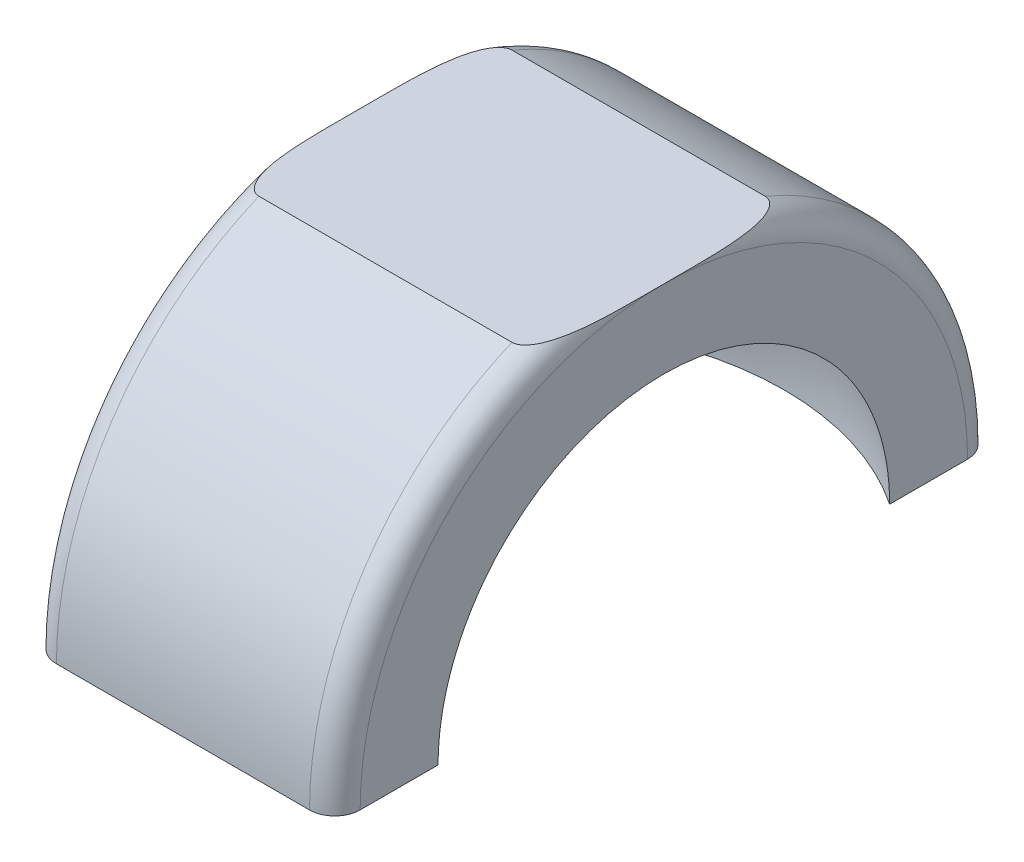
ISO-10303-21;
HEADER;
FILE_DESCRIPTION(('STEP AP214'),'2;1');
FILE_NAME('part.step','',(''),(''),'','','');
FILE_SCHEMA(('AUTOMOTIVE_DESIGN { 1 0 10303 214 1 1 1 1 }'));
ENDSEC;
DATA;
#1=APPLICATION_CONTEXT('core data for automotive mechanical design processes');
#2=APPLICATION_PROTOCOL_DEFINITION('international standard','automotive_design',2000,#1);
#3=PRODUCT_CONTEXT('',#1,'mechanical');
#4=PRODUCT('Part','Part','',(#3));
#5=PRODUCT_RELATED_PRODUCT_CATEGORY('part','',(#4));
#6=PRODUCT_DEFINITION_FORMATION('','',#4);
#7=PRODUCT_DEFINITION_CONTEXT('part definition',#1,'design');
#8=PRODUCT_DEFINITION('design','',#6,#7);
#9=PRODUCT_DEFINITION_SHAPE('','',#8);
#10=(LENGTH_UNIT() NAMED_UNIT(*) SI_UNIT(.MILLI.,.METRE.));
#11=(NAMED_UNIT(*) PLANE_ANGLE_UNIT() SI_UNIT($,.RADIAN.));
#12=(NAMED_UNIT(*) SI_UNIT($,.STERADIAN.) SOLID_ANGLE_UNIT());
#13=UNCERTAINTY_MEASURE_WITH_UNIT(LENGTH_MEASURE(1.E-05),#10,'distance_accuracy_value','');
#14=(GEOMETRIC_REPRESENTATION_CONTEXT(3) GLOBAL_UNCERTAINTY_ASSIGNED_CONTEXT((#13)) GLOBAL_UNIT_ASSIGNED_CONTEXT((#10,
#11,#12)) REPRESENTATION_CONTEXT('',''));
#15=CARTESIAN_POINT('',(0.,0.,0.));
#16=DIRECTION('',(0.,0.,1.));
#17=DIRECTION('',(1.,0.,0.));
#18=AXIS2_PLACEMENT_3D('',#15,#16,#17);
#19=CARTESIAN_POINT('',(10.,0.,0.));
#20=DIRECTION('',(-1.,0.,0.));
#21=DIRECTION('',(0.,0.,1.));
#22=AXIS2_PLACEMENT_3D('',#19,#20,#21);
#23=TOROIDAL_SURFACE('',#22,24.,2.);
#24=CARTESIAN_POINT('',(12.,0.,0.));
#25=DIRECTION('',(-1.,0.,0.));
#26=DIRECTION('',(0.,0.,1.));
#27=AXIS2_PLACEMENT_3D('',#24,#25,#26);
#28=CIRCLE('',#27,24.);
#29=CARTESIAN_POINT('',(12.,0.,24.));
#30=VERTEX_POINT('',#29);
#31=CARTESIAN_POINT('',(12.,24.,0.));
#32=VERTEX_POINT('',#31);
#33=EDGE_CURVE('E41',#30,#32,#28,.T.);
#34=ORIENTED_EDGE('',*,*,#33,.T.);
#35=CARTESIAN_POINT('',(12.0000000000002,24.,0.));
#36=CARTESIAN_POINT('',(12.0000032112972,24.,0.333318370624944));
#37=CARTESIAN_POINT('',(12.0000369376425,24.,0.666636690385218));
#38=CARTESIAN_POINT('',(11.9997462691406,24.,1.33327477904077));
#39=CARTESIAN_POINT('',(11.9994218731332,24.,1.66659454793725));
#40=CARTESIAN_POINT('',(11.9971167553539,24.,2.33330585522278));
#41=CARTESIAN_POINT('',(11.995135657108,24.,2.66669739270359));
#42=CARTESIAN_POINT('',(11.987382631693,24.,3.33342237898503));
#43=CARTESIAN_POINT('',(11.9816110138256,24.,3.66675583030574));
#44=CARTESIAN_POINT('',(11.9660821554231,24.,4.22925457777455));
#45=CARTESIAN_POINT('',(11.9581306579488,24.,4.45846690104528));
#46=CARTESIAN_POINT('',(11.9376839843161,24.,4.91668810412272));
#47=CARTESIAN_POINT('',(11.9251890218679,24.,5.14569699299054));
#48=CARTESIAN_POINT('',(11.8940563210572,24.,5.60339568674352));
#49=CARTESIAN_POINT('',(11.8754163137367,24.,5.83208534238817));
#50=CARTESIAN_POINT('',(11.8299717017088,24.,6.28863487959647));
#51=CARTESIAN_POINT('',(11.8031689811131,24.,6.5164949403774));
#52=CARTESIAN_POINT('',(11.7472776739321,24.,6.91014618979482));
#53=CARTESIAN_POINT('',(11.7207036250663,24.,7.07628927305245));
#54=CARTESIAN_POINT('',(11.6602651251751,24.,7.40722844639932));
#55=CARTESIAN_POINT('',(11.6264021712281,24.,7.57202480589031));
#56=CARTESIAN_POINT('',(11.5494119212752,24.,7.89981844597661));
#57=CARTESIAN_POINT('',(11.5062684373758,24.,8.06281205295968));
#58=CARTESIAN_POINT('',(11.4325985380382,24.,8.3045026196003));
#59=CARTESIAN_POINT('',(11.4065607418726,24.,8.38457040780352));
#60=CARTESIAN_POINT('',(11.3510253330141,24.,8.54349044057223));
#61=CARTESIAN_POINT('',(11.321528415153,24.,8.62234292566682));
#62=CARTESIAN_POINT('',(11.2581656766794,24.,8.77926831696839));
#63=CARTESIAN_POINT('',(11.2242565034422,24.,8.85732386543028));
#64=CARTESIAN_POINT('',(11.1515835022793,24.,9.01112038904928));
#65=CARTESIAN_POINT('',(11.1128221897752,24.,9.08686253837903));
#66=CARTESIAN_POINT('',(11.0297277782235,24.,9.23464189441576));
#67=CARTESIAN_POINT('',(10.9854309122107,24.,9.3066992506055));
#68=CARTESIAN_POINT('',(10.8899193526613,24.,9.44601447281588));
#69=CARTESIAN_POINT('',(10.8387168937979,24.,9.51328051264976));
#70=CARTESIAN_POINT('',(10.7452380030842,24.,9.62063081920906));
#71=CARTESIAN_POINT('',(10.7051812793181,24.,9.66263473592002));
#72=CARTESIAN_POINT('',(10.6205313029516,24.,9.74197770663356));
#73=CARTESIAN_POINT('',(10.5759332419576,24.,9.77931172096246));
#74=CARTESIAN_POINT('',(10.4813819449202,24.,9.84781787827383));
#75=CARTESIAN_POINT('',(10.4313750129516,24.,9.87891742712105));
#76=CARTESIAN_POINT('',(10.3266729907569,24.,9.93185418938677));
#77=CARTESIAN_POINT('',(10.2719900844932,24.,9.95371464266827));
#78=CARTESIAN_POINT('',(10.1730273511311,24.,9.98169520964225));
#79=CARTESIAN_POINT('',(10.129468790481,24.,9.99035573108248));
#80=CARTESIAN_POINT('',(10.0415136477378,24.,10.0001366298849));
#81=CARTESIAN_POINT('',(9.99711761101358,24.,10.0012617551721));
#82=CARTESIAN_POINT('',(9.90882676394153,24.,9.99586257111336));
#83=CARTESIAN_POINT('',(9.86493171650638,24.,9.98934204559354));
#84=CARTESIAN_POINT('',(9.77878109124616,24.,9.96928364420115));
#85=CARTESIAN_POINT('',(9.7365269146013,24.,9.95573990676722));
#86=CARTESIAN_POINT('',(9.63992720292629,24.,9.91684528754731));
#87=CARTESIAN_POINT('',(9.58658719557515,24.,9.88901308058598));
#88=CARTESIAN_POINT('',(9.48501505356487,24.,9.82524143179271));
#89=CARTESIAN_POINT('',(9.43679494660291,24.,9.78928349439656));
#90=CARTESIAN_POINT('',(9.31596862747712,24.,9.6866929371816));
#91=CARTESIAN_POINT('',(9.24755308269309,24.,9.61517616781321));
#92=CARTESIAN_POINT('',(9.12173798187126,24.,9.46311544551836));
#93=CARTESIAN_POINT('',(9.06436974993364,24.,9.38254682034423));
#94=CARTESIAN_POINT('',(8.95651782036297,24.,9.21279170083568));
#95=CARTESIAN_POINT('',(8.90636765207394,24.,9.12339658073665));
#96=CARTESIAN_POINT('',(8.81362150969052,24.,8.9407222863304));
#97=CARTESIAN_POINT('',(8.77103405557575,24.,8.84743887576215));
#98=CARTESIAN_POINT('',(8.69200154728926,24.,8.65821094587404));
#99=CARTESIAN_POINT('',(8.65556358713586,24.,8.56226349986666));
#100=CARTESIAN_POINT('',(8.58785036928036,24.,8.36865771043921));
#101=CARTESIAN_POINT('',(8.55657165945949,24.,8.27100055979621));
#102=CARTESIAN_POINT('',(8.49452950865645,24.,8.06158756638733));
#103=CARTESIAN_POINT('',(8.46436615854089,24.,7.94965518527957));
#104=CARTESIAN_POINT('',(8.40865247510728,24.,7.7246404670472));
#105=CARTESIAN_POINT('',(8.38310307614887,24.,7.6115579018884));
#106=CARTESIAN_POINT('',(8.31224888257978,24.,7.2709188779993));
#107=CARTESIAN_POINT('',(8.27278734062413,24.,7.04214664364708));
#108=CARTESIAN_POINT('',(8.20517744522899,24.,6.58219576041598));
#109=CARTESIAN_POINT('',(8.17706983811534,24.,6.35101144599837));
#110=CARTESIAN_POINT('',(8.12947856099722,24.,5.8877340102058));
#111=CARTESIAN_POINT('',(8.10999655460494,24.,5.65564072221853));
#112=CARTESIAN_POINT('',(8.07725644923241,24.,5.18768771328294));
#113=CARTESIAN_POINT('',(8.06409170355674,24.,4.95182174939653));
#114=CARTESIAN_POINT('',(8.04263936971829,24.,4.47985352954237));
#115=CARTESIAN_POINT('',(8.03435229573301,24.,4.24375125129052));
#116=CARTESIAN_POINT('',(8.02126725748994,24.,3.77221548470928));
#117=CARTESIAN_POINT('',(8.01645816840742,24.,3.53678228489565));
#118=CARTESIAN_POINT('',(8.00916079848506,24.,3.0658976655751));
#119=CARTESIAN_POINT('',(8.00667237456718,24.,2.83044624808663));
#120=CARTESIAN_POINT('',(8.00314726486056,24.,2.36271223492861));
#121=CARTESIAN_POINT('',(8.00209143795818,24.,2.13042976235398));
#122=CARTESIAN_POINT('',(8.00071789688515,24.,1.66586244272779));
#123=CARTESIAN_POINT('',(8.00040018509202,24.,1.43357759567101));
#124=CARTESIAN_POINT('',(8.00005119091622,24.,0.968972711085982));
#125=CARTESIAN_POINT('',(8.00001995184136,24.,0.736652673546385));
#126=CARTESIAN_POINT('',(7.99999408475305,24.,0.272013202606699));
#127=CARTESIAN_POINT('',(7.99999945664451,24.,0.0396937692066078));
#128=CARTESIAN_POINT('',(8.00000084678883,24.,-0.426510676514846));
#129=CARTESIAN_POINT('',(7.9999968017643,24.,-0.660395688814065));
#130=CARTESIAN_POINT('',(8.00014190259765,24.,-1.12816670466346));
#131=CARTESIAN_POINT('',(8.00029104909999,24.,-1.36205270821367));
#132=CARTESIAN_POINT('',(8.00111370574869,24.,-1.82969701927461));
#133=CARTESIAN_POINT('',(8.00178693088462,24.,-2.06345532710612));
#134=CARTESIAN_POINT('',(8.0042336004762,24.,-2.53096518392172));
#135=CARTESIAN_POINT('',(8.00600703510534,24.,-2.76471673294754));
#136=CARTESIAN_POINT('',(8.01137795427343,24.,-3.22707915213118));
#137=CARTESIAN_POINT('',(8.01493462465703,24.,-3.45569044824237));
#138=CARTESIAN_POINT('',(8.02478304215701,24.,-3.91285583709429));
#139=CARTESIAN_POINT('',(8.03107475920861,24.,-4.14140993043618));
#140=CARTESIAN_POINT('',(8.04756811288698,24.,-4.59893086306326));
#141=CARTESIAN_POINT('',(8.05777905958928,24.,-4.82789738305847));
#142=CARTESIAN_POINT('',(8.08354488483207,24.,-5.28551435799917));
#143=CARTESIAN_POINT('',(8.09909907992984,24.,-5.51416484961358));
#144=CARTESIAN_POINT('',(8.13712372410515,24.,-5.96806426630645));
#145=CARTESIAN_POINT('',(8.15950647070729,24.,-6.19332035270045));
#146=CARTESIAN_POINT('',(8.21348655696245,24.,-6.64272797005468));
#147=CARTESIAN_POINT('',(8.2450817096124,24.,-6.86687975034626));
#148=CARTESIAN_POINT('',(8.30163784859851,24.,-7.20113297539648));
#149=CARTESIAN_POINT('',(8.32197124184282,24.,-7.31201894796625));
#150=CARTESIAN_POINT('',(8.36620724524363,24.,-7.53307208686932));
#151=CARTESIAN_POINT('',(8.39010944562003,24.,-7.64323933421482));
#152=CARTESIAN_POINT('',(8.44206801029076,24.,-7.86247240563955));
#153=CARTESIAN_POINT('',(8.47011992287844,24.,-7.97153927786498));
#154=CARTESIAN_POINT('',(8.5311633401834,24.,-8.18827023811862));
#155=CARTESIAN_POINT('',(8.56415327897659,24.,-8.29593475913078));
#156=CARTESIAN_POINT('',(8.61466662939372,24.,-8.44574106167869));
#157=CARTESIAN_POINT('',(8.6297032570958,24.,-8.48872635133043));
#158=CARTESIAN_POINT('',(8.66083866445632,24.,-8.5743183232767));
#159=CARTESIAN_POINT('',(8.67693762337307,24.,-8.6169249402904));
#160=CARTESIAN_POINT('',(8.72699164897903,24.,-8.74415829254694));
#161=CARTESIAN_POINT('',(8.76267715155773,24.,-8.82811809808563));
#162=CARTESIAN_POINT('',(8.83931969761989,24.,-8.99302837938143));
#163=CARTESIAN_POINT('',(8.88024511873908,24.,-9.07399342998768));
#164=CARTESIAN_POINT('',(8.96863876303755,24.,-9.23222566903728));
#165=CARTESIAN_POINT('',(9.01609931038123,24.,-9.30949705450595));
#166=CARTESIAN_POINT('',(9.10636111904431,24.,-9.44011000529705));
#167=CARTESIAN_POINT('',(9.14741752266106,24.,-9.49464784915385));
#168=CARTESIAN_POINT('',(9.23499202878933,24.,-9.59941876467231));
#169=CARTESIAN_POINT('',(9.28152108088911,24.,-9.64964284594727));
#170=CARTESIAN_POINT('',(9.3813411272815,24.,-9.74420685424307));
#171=CARTESIAN_POINT('',(9.43470272076706,24.,-9.78847371669067));
#172=CARTESIAN_POINT('',(9.54823001297531,24.,-9.86718895224718));
#173=CARTESIAN_POINT('',(9.60837134174992,24.,-9.9016710178199));
#174=CARTESIAN_POINT('',(9.7135502774502,24.,-9.94747630826742));
#175=CARTESIAN_POINT('',(9.75688505479648,24.,-9.9626880147675));
#176=CARTESIAN_POINT('',(9.84548101624645,24.,-9.98574109251738));
#177=CARTESIAN_POINT('',(9.89074030445104,24.,-9.99358954941912));
#178=CARTESIAN_POINT('',(9.98212867114721,24.,-10.0011557954406));
#179=CARTESIAN_POINT('',(10.0282604715755,24.,-10.0008414669901));
#180=CARTESIAN_POINT('',(10.1197394795816,24.,-9.99203622265434));
#181=CARTESIAN_POINT('',(10.1650863089253,24.,-9.98354147090436));
#182=CARTESIAN_POINT('',(10.2518309149631,24.,-9.95974527501826));
#183=CARTESIAN_POINT('',(10.2933146290992,24.,-9.94474933730522));
#184=CARTESIAN_POINT('',(10.3737684132198,24.,-9.90915072481761));
#185=CARTESIAN_POINT('',(10.4127375521171,24.,-9.88854598780835));
#186=CARTESIAN_POINT('',(10.514310353692,24.,-9.82681028590918));
#187=CARTESIAN_POINT('',(10.5743167505716,24.,-9.78141983209891));
#188=CARTESIAN_POINT('',(10.6867601738288,24.,-9.68204746446342));
#189=CARTESIAN_POINT('',(10.7391710802959,24.,-9.6280371860263));
#190=CARTESIAN_POINT('',(10.8334718249548,24.,-9.51885468523465));
#191=CARTESIAN_POINT('',(10.8758653995675,24.,-9.46410990591669));
#192=CARTESIAN_POINT('',(10.955865319261,24.,-9.35119562209922));
#193=CARTESIAN_POINT('',(10.993467288732,24.,-9.29302305728638));
#194=CARTESIAN_POINT('',(11.0646165213932,24.,-9.17413072766235));
#195=CARTESIAN_POINT('',(11.0981563479977,24.,-9.11340655728604));
#196=CARTESIAN_POINT('',(11.1616716941555,24.,-8.99016734569872));
#197=CARTESIAN_POINT('',(11.1916485345535,24.,-8.92765297886867));
#198=CARTESIAN_POINT('',(11.2622823804187,24.,-8.77070588448407));
#199=CARTESIAN_POINT('',(11.3011003935321,24.,-8.67544711598761));
#200=CARTESIAN_POINT('',(11.3732088503867,24.,-8.48284081520179));
#201=CARTESIAN_POINT('',(11.406496512795,24.,-8.38549225953626));
#202=CARTESIAN_POINT('',(11.4684843216113,24.,-8.18917313339979));
#203=CARTESIAN_POINT('',(11.4971765073101,24.,-8.09020006880909));
#204=CARTESIAN_POINT('',(11.550609774882,24.,-7.89118646355778));
#205=CARTESIAN_POINT('',(11.575350152715,24.,-7.79114573606544));
#206=CARTESIAN_POINT('',(11.6447376713912,24.,-7.48887108554338));
#207=CARTESIAN_POINT('',(11.6842576192666,24.,-7.28545818128766));
#208=CARTESIAN_POINT('',(11.7530008244918,24.,-6.87720545550559));
#209=CARTESIAN_POINT('',(11.7822352536171,24.,-6.67236743013971));
#210=CARTESIAN_POINT('',(11.8405401585336,24.,-6.19926402227572));
#211=CARTESIAN_POINT('',(11.8668540655969,24.,-5.93066406958119));
#212=CARTESIAN_POINT('',(11.9099344136815,24.,-5.39268113493136));
#213=CARTESIAN_POINT('',(11.9266983618385,24.,-5.12329796695763));
#214=CARTESIAN_POINT('',(11.9534755921896,24.,-4.58390967942385));
#215=CARTESIAN_POINT('',(11.9634812739808,24.,-4.31390420114343));
#216=CARTESIAN_POINT('',(11.9788819188098,24.,-3.77375930489971));
#217=CARTESIAN_POINT('',(11.9842766375968,24.,-3.50361988059937));
#218=CARTESIAN_POINT('',(11.9921348699951,24.,-2.96395555881359));
#219=CARTESIAN_POINT('',(11.9946054270657,24.,-2.69443075182466));
#220=CARTESIAN_POINT('',(11.9979221739512,24.,-2.15536833218577));
#221=CARTESIAN_POINT('',(11.998768333373,24.,-1.88583071939057));
#222=CARTESIAN_POINT('',(11.9997534150278,24.,-1.34691063250215));
#223=CARTESIAN_POINT('',(11.9998927458558,24.,-1.07752815880793));
#224=CARTESIAN_POINT('',(12.0000147405231,24.,-0.538763779001592));
#225=CARTESIAN_POINT('',(11.9999974046881,24.,-0.269381872889463));
#226=CARTESIAN_POINT('',(12.0000000000002,24.,0.));
#227=B_SPLINE_CURVE_WITH_KNOTS('',3,(#35,#36,#37,#38,#39,#40,#41,#42,#43,#44,#45,#46,#47,#48,
#49,#50,#51,#52,#53,#54,#55,#56,#57,#58,#59,#60,#61,#62,#63,#64,#65,#66,#67,#68,#69,#70,#71,#72,
#73,#74,#75,#76,#77,#78,#79,#80,#81,#82,#83,#84,#85,#86,#87,#88,#89,#90,#91,#92,#93,#94,#95,#96,
#97,#98,#99,#100,#101,#102,#103,#104,#105,#106,#107,#108,#109,#110,#111,#112,#113,#114,#115,
#116,#117,#118,#119,#120,#121,#122,#123,#124,#125,#126,#127,#128,#129,#130,#131,#132,#133,#134,
#135,#136,#137,#138,#139,#140,#141,#142,#143,#144,#145,#146,#147,#148,#149,#150,#151,#152,#153,
#154,#155,#156,#157,#158,#159,#160,#161,#162,#163,#164,#165,#166,#167,#168,#169,#170,#171,#172,
#173,#174,#175,#176,#177,#178,#179,#180,#181,#182,#183,#184,#185,#186,#187,#188,#189,#190,#191,
#192,#193,#194,#195,#196,#197,#198,#199,#200,#201,#202,#203,#204,#205,#206,#207,#208,#209,#210,
#211,#212,#213,#214,#215,#216,#217,#218,#219,#220,#221,#222,#223,#224,#225,#226),.UNSPECIFIED.,
.T.,.F.,(4,2,2,2,2,2,2,2,2,2,2,2,2,2,2,2,2,2,2,2,2,2,2,2,2,2,2,2,2,2,2,2,2,2,2,2,2,2,2,2,2,2,2,
2,2,2,2,2,2,2,2,2,2,2,2,2,2,2,2,2,2,2,2,2,2,2,2,2,2,2,2,2,2,2,2,2,2,2,2,2,2,2,2,2,2,2,2,2,2,2,2,
2,2,2,2,4),(0.,0.99995520066757,1.99991364085758,3.00009937632531,4.00020350803274,
4.68822289830605,5.37620993050771,6.06445127579582,6.7525338819526,7.25716920444684,
7.76170097792134,8.26712004020252,8.5196428665089,8.77211505530158,9.02728751227203,
9.28232822765567,9.53577935003109,9.78878719038112,9.96263311325961,10.1366650578676,
10.3126187322994,10.4881271430685,10.6207682454853,10.7533257651287,10.8858177098474,
11.0184204105261,11.1978955251223,11.377783346028,11.6730245875488,11.9690910269845,
12.2761189589302,12.5834906169361,12.89121446854,13.1987315755983,13.5463854768731,
13.8941097019101,14.5901038270583,15.2885739657189,15.9871787590936,16.6958114613416,
17.4045188504047,18.1109491903295,18.8173359731965,19.5141884914985,20.2110432544059,
20.908003363336,21.6049616623497,22.3066167079768,23.0082747054134,23.7095513855221,
24.4108218022766,25.0967281630302,25.7826269842007,26.4701653345502,27.1576157761593,
27.8365842680351,28.515391705474,28.8535504002588,29.1916702965621,29.5294300620778,
29.8670829448073,30.0036890418505,30.1403182491153,30.4138306184936,30.6857639793563,
30.9573806228073,31.1619053410741,31.3668464624063,31.5741081042875,31.7806471634418,
31.9178874178861,32.0549954702209,32.1926430739583,32.330355253181,32.4621986005242,
32.594090489457,32.8185048924268,33.0436735917432,33.2510871706001,33.4586888188927,
33.666664956936,33.8745637534841,34.1829259351316,34.4914427323997,34.8004883218504,
35.1095889084977,35.7308334264169,36.3514010715602,37.1607941011896,37.9703983132472,
38.7809115037339,39.5914676258798,40.4000673537083,41.2086822105647,42.0168295797907,
42.8249752702198),.UNSPECIFIED.);
#228=CARTESIAN_POINT('',(9.99999999999999,24.,9.99999999999999));
#229=VERTEX_POINT('',#228);
#230=EDGE_CURVE('E104',#32,#229,#227,.T.);
#231=ORIENTED_EDGE('',*,*,#230,.T.);
#232=CARTESIAN_POINT('',(9.99999999999999,0.,0.));
#233=DIRECTION('',(-1.,0.,0.));
#234=DIRECTION('',(0.,0.,1.));
#235=AXIS2_PLACEMENT_3D('',#232,#233,#234);
#236=CIRCLE('',#235,26.);
#237=CARTESIAN_POINT('',(9.99999999999999,0.,26.));
#238=VERTEX_POINT('',#237);
#239=EDGE_CURVE('E128',#238,#229,#236,.T.);
#240=ORIENTED_EDGE('',*,*,#239,.F.);
#241=CARTESIAN_POINT('',(10.,0.,24.));
#242=DIRECTION('',(0.,-1.,0.));
#243=DIRECTION('',(1.,0.,0.));
#244=AXIS2_PLACEMENT_3D('',#241,#242,#243);
#245=CIRCLE('',#244,2.);
#246=EDGE_CURVE('E126',#30,#238,#245,.T.);
#247=ORIENTED_EDGE('',*,*,#246,.F.);
#248=EDGE_LOOP('',(#34,#231,#240,#247));
#249=FACE_BOUND('',#248,.T.);
#250=ADVANCED_FACE('F33',(#249),#23,.T.);
#251=CARTESIAN_POINT('',(-22.,0.,0.));
#252=DIRECTION('',(-1.,0.,0.));
#253=DIRECTION('',(0.,0.,1.));
#254=AXIS2_PLACEMENT_3D('',#251,#252,#253);
#255=CYLINDRICAL_SURFACE('',#254,26.);
#256=DIRECTION('',(-1.,0.,0.));
#257=VECTOR('',#256,1.);
#258=CARTESIAN_POINT('',(-22.,24.,9.99999999999999));
#259=LINE('',#258,#257);
#260=CARTESIAN_POINT('',(-9.99999999999971,24.,10.0000000000003));
#261=VERTEX_POINT('',#260);
#262=EDGE_CURVE('E110',#261,#229,#259,.F.);
#263=ORIENTED_EDGE('',*,*,#262,.F.);
#264=CARTESIAN_POINT('',(-9.99999999999998,0.,0.));
#265=DIRECTION('',(-1.,0.,0.));
#266=DIRECTION('',(0.,0.,1.));
#267=AXIS2_PLACEMENT_3D('',#264,#265,#266);
#268=CIRCLE('',#267,26.);
#269=CARTESIAN_POINT('',(-9.99999999999998,0.,26.));
#270=VERTEX_POINT('',#269);
#271=EDGE_CURVE('E132',#270,#261,#268,.T.);
#272=ORIENTED_EDGE('',*,*,#271,.F.);
#273=DIRECTION('',(1.,0.,0.));
#274=VECTOR('',#273,1.);
#275=CARTESIAN_POINT('',(-9.99999999999998,0.,26.));
#276=LINE('',#275,#274);
#277=EDGE_CURVE('E146',#270,#238,#276,.T.);
#278=ORIENTED_EDGE('',*,*,#277,.T.);
#279=ORIENTED_EDGE('',*,*,#239,.T.);
#280=EDGE_LOOP('',(#263,#272,#278,#279));
#281=FACE_BOUND('',#280,.T.);
#282=ADVANCED_FACE('F203',(#281),#255,.T.);
#283=CARTESIAN_POINT('',(-10.,0.,0.));
#284=DIRECTION('',(-1.,0.,0.));
#285=DIRECTION('',(0.,0.,1.));
#286=AXIS2_PLACEMENT_3D('',#283,#284,#285);
#287=TOROIDAL_SURFACE('',#286,24.,2.);
#288=CARTESIAN_POINT('',(-12.,0.,0.));
#289=DIRECTION('',(-1.,0.,0.));
#290=DIRECTION('',(0.,0.,1.));
#291=AXIS2_PLACEMENT_3D('',#288,#289,#290);
#292=CIRCLE('',#291,24.);
#293=CARTESIAN_POINT('',(-12.,24.,0.));
#294=VERTEX_POINT('',#293);
#295=CARTESIAN_POINT('',(-12.,0.,-24.));
#296=VERTEX_POINT('',#295);
#297=EDGE_CURVE('E139',#294,#296,#292,.T.);
#298=ORIENTED_EDGE('',*,*,#297,.F.);
#299=CARTESIAN_POINT('',(-12.0000000000002,24.,0.));
#300=CARTESIAN_POINT('',(-12.0000032112972,24.,-0.333318370624944));
#301=CARTESIAN_POINT('',(-12.0000369376425,24.,-0.666636690385219));
#302=CARTESIAN_POINT('',(-11.9997462691406,24.,-1.33327477904078));
#303=CARTESIAN_POINT('',(-11.9994218731332,24.,-1.66659454793725));
#304=CARTESIAN_POINT('',(-11.9971167553539,24.,-2.33330585522278));
#305=CARTESIAN_POINT('',(-11.995135657108,24.,-2.66669739270359));
#306=CARTESIAN_POINT('',(-11.987382631693,24.,-3.33342237898503));
#307=CARTESIAN_POINT('',(-11.9816110138256,24.,-3.66675583030574));
#308=CARTESIAN_POINT('',(-11.9660821554231,24.,-4.22925457777455));
#309=CARTESIAN_POINT('',(-11.9581306579488,24.,-4.45846690104528));
#310=CARTESIAN_POINT('',(-11.9376839843161,24.,-4.91668810412272));
#311=CARTESIAN_POINT('',(-11.9251890218679,24.,-5.14569699299054));
#312=CARTESIAN_POINT('',(-11.8940563210572,24.,-5.60339568674351));
#313=CARTESIAN_POINT('',(-11.8754163137367,24.,-5.83208534238818));
#314=CARTESIAN_POINT('',(-11.8299717017088,24.,-6.28863487959647));
#315=CARTESIAN_POINT('',(-11.8031689811131,24.,-6.5164949403774));
#316=CARTESIAN_POINT('',(-11.7472776739321,24.,-6.91014618979482));
#317=CARTESIAN_POINT('',(-11.7207036250663,24.,-7.07628927305246));
#318=CARTESIAN_POINT('',(-11.6602651251751,24.,-7.40722844639932));
#319=CARTESIAN_POINT('',(-11.6264021712281,24.,-7.57202480589032));
#320=CARTESIAN_POINT('',(-11.5494119212752,24.,-7.89981844597661));
#321=CARTESIAN_POINT('',(-11.5062684373758,24.,-8.06281205295969));
#322=CARTESIAN_POINT('',(-11.4325985380382,24.,-8.30450261960031));
#323=CARTESIAN_POINT('',(-11.4065607418726,24.,-8.38457040780352));
#324=CARTESIAN_POINT('',(-11.3510253330141,24.,-8.54349044057223));
#325=CARTESIAN_POINT('',(-11.321528415153,24.,-8.62234292566683));
#326=CARTESIAN_POINT('',(-11.2581656766794,24.,-8.77926831696839));
#327=CARTESIAN_POINT('',(-11.2242565034422,24.,-8.85732386543029));
#328=CARTESIAN_POINT('',(-11.1515835022793,24.,-9.01112038904928));
#329=CARTESIAN_POINT('',(-11.1128221897752,24.,-9.08686253837904));
#330=CARTESIAN_POINT('',(-11.0297277782235,24.,-9.23464189441576));
#331=CARTESIAN_POINT('',(-10.9854309122107,24.,-9.3066992506055));
#332=CARTESIAN_POINT('',(-10.8899193526613,24.,-9.44601447281589));
#333=CARTESIAN_POINT('',(-10.8387168937979,24.,-9.51328051264976));
#334=CARTESIAN_POINT('',(-10.7452380030842,24.,-9.62063081920907));
#335=CARTESIAN_POINT('',(-10.7051812793181,24.,-9.66263473592003));
#336=CARTESIAN_POINT('',(-10.6205313029516,24.,-9.74197770663357));
#337=CARTESIAN_POINT('',(-10.5759332419576,24.,-9.77931172096247));
#338=CARTESIAN_POINT('',(-10.4813819449202,24.,-9.84781787827384));
#339=CARTESIAN_POINT('',(-10.4313750129516,24.,-9.87891742712106));
#340=CARTESIAN_POINT('',(-10.3266729907569,24.,-9.93185418938679));
#341=CARTESIAN_POINT('',(-10.2719900844931,24.,-9.95371464266829));
#342=CARTESIAN_POINT('',(-10.1730273511311,24.,-9.98169520964226));
#343=CARTESIAN_POINT('',(-10.129468790481,24.,-9.99035573108248));
#344=CARTESIAN_POINT('',(-10.0415136477378,24.,-10.0001366298849));
#345=CARTESIAN_POINT('',(-9.99711761101358,24.,-10.0012617551721));
#346=CARTESIAN_POINT('',(-9.90882676394152,24.,-9.99586257111337));
#347=CARTESIAN_POINT('',(-9.86493171650638,24.,-9.98934204559354));
#348=CARTESIAN_POINT('',(-9.77878109124616,24.,-9.96928364420116));
#349=CARTESIAN_POINT('',(-9.7365269146013,24.,-9.95573990676723));
#350=CARTESIAN_POINT('',(-9.63992720292629,24.,-9.91684528754733));
#351=CARTESIAN_POINT('',(-9.58658719557514,24.,-9.889013080586));
#352=CARTESIAN_POINT('',(-9.48501505356487,24.,-9.82524143179272));
#353=CARTESIAN_POINT('',(-9.4367949466029,24.,-9.78928349439657));
#354=CARTESIAN_POINT('',(-9.31596862747713,24.,-9.68669293718161));
#355=CARTESIAN_POINT('',(-9.2475530826931,24.,-9.61517616781322));
#356=CARTESIAN_POINT('',(-9.12173798187127,24.,-9.46311544551837));
#357=CARTESIAN_POINT('',(-9.06436974993364,24.,-9.38254682034425));
#358=CARTESIAN_POINT('',(-8.95651782036297,24.,-9.21279170083571));
#359=CARTESIAN_POINT('',(-8.90636765207394,24.,-9.12339658073668));
#360=CARTESIAN_POINT('',(-8.81362150969052,24.,-8.94072228633042));
#361=CARTESIAN_POINT('',(-8.77103405557576,24.,-8.84743887576218));
#362=CARTESIAN_POINT('',(-8.69200154728927,24.,-8.65821094587407));
#363=CARTESIAN_POINT('',(-8.65556358713586,24.,-8.56226349986668));
#364=CARTESIAN_POINT('',(-8.58785036928036,24.,-8.36865771043923));
#365=CARTESIAN_POINT('',(-8.55657165945949,24.,-8.27100055979624));
#366=CARTESIAN_POINT('',(-8.49452950865645,24.,-8.06158756638736));
#367=CARTESIAN_POINT('',(-8.46436615854089,24.,-7.9496551852796));
#368=CARTESIAN_POINT('',(-8.40865247510728,24.,-7.72464046704724));
#369=CARTESIAN_POINT('',(-8.38310307614887,24.,-7.61155790188844));
#370=CARTESIAN_POINT('',(-8.31224888257978,24.,-7.27091887799935));
#371=CARTESIAN_POINT('',(-8.27278734062413,24.,-7.04214664364713));
#372=CARTESIAN_POINT('',(-8.20517744522899,24.,-6.58219576041603));
#373=CARTESIAN_POINT('',(-8.17706983811534,24.,-6.35101144599842));
#374=CARTESIAN_POINT('',(-8.12947856099722,24.,-5.88773401020586));
#375=CARTESIAN_POINT('',(-8.10999655460495,24.,-5.65564072221859));
#376=CARTESIAN_POINT('',(-8.07725644923241,24.,-5.18768771328301));
#377=CARTESIAN_POINT('',(-8.06409170355674,24.,-4.95182174939661));
#378=CARTESIAN_POINT('',(-8.04263936971829,24.,-4.47985352954246));
#379=CARTESIAN_POINT('',(-8.03435229573301,24.,-4.24375125129062));
#380=CARTESIAN_POINT('',(-8.02126725748994,24.,-3.77221548470939));
#381=CARTESIAN_POINT('',(-8.01645816840742,24.,-3.53678228489576));
#382=CARTESIAN_POINT('',(-8.00916079848506,24.,-3.06589766557523));
#383=CARTESIAN_POINT('',(-8.00667237456718,24.,-2.83044624808675));
#384=CARTESIAN_POINT('',(-8.00314726486056,24.,-2.36271223492875));
#385=CARTESIAN_POINT('',(-8.00209143795817,24.,-2.13042976235412));
#386=CARTESIAN_POINT('',(-8.00071789688514,24.,-1.66586244272795));
#387=CARTESIAN_POINT('',(-8.00040018509202,24.,-1.43357759567117));
#388=CARTESIAN_POINT('',(-8.00005119091622,24.,-0.968972711086151));
#389=CARTESIAN_POINT('',(-8.00001995184136,24.,-0.736652673546559));
#390=CARTESIAN_POINT('',(-7.99999408475304,24.,-0.272013202606883));
#391=CARTESIAN_POINT('',(-7.99999945664451,24.,-0.0396937692067972));
#392=CARTESIAN_POINT('',(-8.00000084678882,24.,0.426510676514644));
#393=CARTESIAN_POINT('',(-7.9999968017643,24.,0.660395688813856));
#394=CARTESIAN_POINT('',(-8.00014190259765,24.,1.12816670466324));
#395=CARTESIAN_POINT('',(-8.00029104909998,24.,1.36205270821344));
#396=CARTESIAN_POINT('',(-8.00111370574869,24.,1.82969701927437));
#397=CARTESIAN_POINT('',(-8.00178693088462,24.,2.06345532710587));
#398=CARTESIAN_POINT('',(-8.0042336004762,24.,2.53096518392146));
#399=CARTESIAN_POINT('',(-8.00600703510534,24.,2.76471673294727));
#400=CARTESIAN_POINT('',(-8.01137795427343,24.,3.22707915213091));
#401=CARTESIAN_POINT('',(-8.01493462465702,24.,3.45569044824209));
#402=CARTESIAN_POINT('',(-8.024783042157,24.,3.912855837094));
#403=CARTESIAN_POINT('',(-8.03107475920859,24.,4.14140993043589));
#404=CARTESIAN_POINT('',(-8.04756811288696,24.,4.59893086306296));
#405=CARTESIAN_POINT('',(-8.05777905958926,24.,4.82789738305817));
#406=CARTESIAN_POINT('',(-8.08354488483205,24.,5.28551435799886));
#407=CARTESIAN_POINT('',(-8.09909907992981,24.,5.51416484961327));
#408=CARTESIAN_POINT('',(-8.13712372410512,24.,5.96806426630612));
#409=CARTESIAN_POINT('',(-8.15950647070726,24.,6.19332035270012));
#410=CARTESIAN_POINT('',(-8.21348655696241,24.,6.64272797005435));
#411=CARTESIAN_POINT('',(-8.24508170961234,24.,6.86687975034592));
#412=CARTESIAN_POINT('',(-8.30163784859844,24.,7.20113297539614));
#413=CARTESIAN_POINT('',(-8.32197124184275,24.,7.31201894796592));
#414=CARTESIAN_POINT('',(-8.36620724524356,24.,7.53307208686899));
#415=CARTESIAN_POINT('',(-8.39010944561994,24.,7.64323933421448));
#416=CARTESIAN_POINT('',(-8.44206801029067,24.,7.86247240563922));
#417=CARTESIAN_POINT('',(-8.47011992287834,24.,7.97153927786463));
#418=CARTESIAN_POINT('',(-8.5311633401833,24.,8.18827023811828));
#419=CARTESIAN_POINT('',(-8.56415327897648,24.,8.29593475913044));
#420=CARTESIAN_POINT('',(-8.61466662939361,24.,8.44574106167837));
#421=CARTESIAN_POINT('',(-8.62970325709568,24.,8.48872635133012));
#422=CARTESIAN_POINT('',(-8.6608386644562,24.,8.5743183232764));
#423=CARTESIAN_POINT('',(-8.67693762337296,24.,8.61692494029011));
#424=CARTESIAN_POINT('',(-8.72699164897891,24.,8.74415829254668));
#425=CARTESIAN_POINT('',(-8.76267715155761,24.,8.82811809808538));
#426=CARTESIAN_POINT('',(-8.83931969761978,24.,8.99302837938122));
#427=CARTESIAN_POINT('',(-8.88024511873898,24.,9.07399342998749));
#428=CARTESIAN_POINT('',(-8.96863876303746,24.,9.23222566903713));
#429=CARTESIAN_POINT('',(-9.01609931038113,24.,9.30949705450583));
#430=CARTESIAN_POINT('',(-9.10636111904422,24.,9.44011000529695));
#431=CARTESIAN_POINT('',(-9.14741752266097,24.,9.49464784915374));
#432=CARTESIAN_POINT('',(-9.23499202878923,24.,9.59941876467222));
#433=CARTESIAN_POINT('',(-9.28152108088901,24.,9.64964284594718));
#434=CARTESIAN_POINT('',(-9.38134112728139,24.,9.74420685424299));
#435=CARTESIAN_POINT('',(-9.43470272076695,24.,9.7884737166906));
#436=CARTESIAN_POINT('',(-9.54823001297519,24.,9.86718895224711));
#437=CARTESIAN_POINT('',(-9.6083713417498,24.,9.90167101781984));
#438=CARTESIAN_POINT('',(-9.71355027745007,24.,9.94747630826738));
#439=CARTESIAN_POINT('',(-9.75688505479636,24.,9.96268801476746));
#440=CARTESIAN_POINT('',(-9.84548101624632,24.,9.98574109251737));
#441=CARTESIAN_POINT('',(-9.89074030445091,24.,9.99358954941911));
#442=CARTESIAN_POINT('',(-9.98212867114709,24.,10.0011557954406));
#443=CARTESIAN_POINT('',(-10.0282604715754,24.,10.0008414669902));
#444=CARTESIAN_POINT('',(-10.1197394795815,24.,9.99203622265438));
#445=CARTESIAN_POINT('',(-10.1650863089252,24.,9.98354147090441));
#446=CARTESIAN_POINT('',(-10.251830914963,24.,9.95974527501832));
#447=CARTESIAN_POINT('',(-10.293314629099,24.,9.94474933730528));
#448=CARTESIAN_POINT('',(-10.3737684132197,24.,9.90915072481767));
#449=CARTESIAN_POINT('',(-10.4127375521169,24.,9.88854598780842));
#450=CARTESIAN_POINT('',(-10.5143103536919,24.,9.82681028590925));
#451=CARTESIAN_POINT('',(-10.5743167505715,24.,9.78141983209901));
#452=CARTESIAN_POINT('',(-10.6867601738286,24.,9.68204746446355));
#453=CARTESIAN_POINT('',(-10.7391710802958,24.,9.62803718602645));
#454=CARTESIAN_POINT('',(-10.8334718249547,24.,9.51885468523483));
#455=CARTESIAN_POINT('',(-10.8758653995673,24.,9.46410990591689));
#456=CARTESIAN_POINT('',(-10.9558653192608,24.,9.35119562209946));
#457=CARTESIAN_POINT('',(-10.9934672887318,24.,9.29302305728664));
#458=CARTESIAN_POINT('',(-11.064616521393,24.,9.17413072766264));
#459=CARTESIAN_POINT('',(-11.0981563479975,24.,9.11340655728635));
#460=CARTESIAN_POINT('',(-11.1616716941553,24.,8.99016734569907));
#461=CARTESIAN_POINT('',(-11.1916485345534,24.,8.92765297886903));
#462=CARTESIAN_POINT('',(-11.2622823804186,24.,8.77070588448449));
#463=CARTESIAN_POINT('',(-11.3011003935319,24.,8.67544711598806));
#464=CARTESIAN_POINT('',(-11.3732088503866,24.,8.48284081520231));
#465=CARTESIAN_POINT('',(-11.4064965127948,24.,8.38549225953682));
#466=CARTESIAN_POINT('',(-11.4684843216111,24.,8.18917313340043));
#467=CARTESIAN_POINT('',(-11.4971765073099,24.,8.09020006880977));
#468=CARTESIAN_POINT('',(-11.5506097748818,24.,7.89118646355853));
#469=CARTESIAN_POINT('',(-11.5753501527149,24.,7.79114573606623));
#470=CARTESIAN_POINT('',(-11.644737671391,24.,7.48887108554428));
#471=CARTESIAN_POINT('',(-11.6842576192664,24.,7.28545818128863));
#472=CARTESIAN_POINT('',(-11.7530008244916,24.,6.87720545550672));
#473=CARTESIAN_POINT('',(-11.7822352536169,24.,6.67236743014091));
#474=CARTESIAN_POINT('',(-11.8405401585334,24.,6.19926402227695));
#475=CARTESIAN_POINT('',(-11.8668540655968,24.,5.93066406958238));
#476=CARTESIAN_POINT('',(-11.9099344136814,24.,5.39268113493244));
#477=CARTESIAN_POINT('',(-11.9266983618385,24.,5.12329796695866));
#478=CARTESIAN_POINT('',(-11.9534755921896,24.,4.58390967942477));
#479=CARTESIAN_POINT('',(-11.9634812739807,24.,4.3139042011443));
#480=CARTESIAN_POINT('',(-11.9788819188098,24.,3.77375930490048));
#481=CARTESIAN_POINT('',(-11.9842766375968,24.,3.50361988060008));
#482=CARTESIAN_POINT('',(-11.9921348699951,24.,2.96395555881419));
#483=CARTESIAN_POINT('',(-11.9946054270657,24.,2.69443075182521));
#484=CARTESIAN_POINT('',(-11.9979221739512,24.,2.15536833218621));
#485=CARTESIAN_POINT('',(-11.998768333373,24.,1.88583071939095));
#486=CARTESIAN_POINT('',(-11.9997534150278,24.,1.34691063250242));
#487=CARTESIAN_POINT('',(-11.9998927458558,24.,1.07752815880814));
#488=CARTESIAN_POINT('',(-12.0000147405231,24.,0.538763779001699));
#489=CARTESIAN_POINT('',(-11.9999974046881,24.,0.269381872889517));
#490=CARTESIAN_POINT('',(-12.0000000000002,24.,0.));
#491=B_SPLINE_CURVE_WITH_KNOTS('',3,(#299,#300,#301,#302,#303,#304,#305,#306,#307,#308,#309,
#310,#311,#312,#313,#314,#315,#316,#317,#318,#319,#320,#321,#322,#323,#324,#325,#326,#327,#328,
#329,#330,#331,#332,#333,#334,#335,#336,#337,#338,#339,#340,#341,#342,#343,#344,#345,#346,#347,
#348,#349,#350,#351,#352,#353,#354,#355,#356,#357,#358,#359,#360,#361,#362,#363,#364,#365,#366,
#367,#368,#369,#370,#371,#372,#373,#374,#375,#376,#377,#378,#379,#380,#381,#382,#383,#384,#385,
#386,#387,#388,#389,#390,#391,#392,#393,#394,#395,#396,#397,#398,#399,#400,#401,#402,#403,#404,
#405,#406,#407,#408,#409,#410,#411,#412,#413,#414,#415,#416,#417,#418,#419,#420,#421,#422,#423,
#424,#425,#426,#427,#428,#429,#430,#431,#432,#433,#434,#435,#436,#437,#438,#439,#440,#441,#442,
#443,#444,#445,#446,#447,#448,#449,#450,#451,#452,#453,#454,#455,#456,#457,#458,#459,#460,#461,
#462,#463,#464,#465,#466,#467,#468,#469,#470,#471,#472,#473,#474,#475,#476,#477,#478,#479,#480,
#481,#482,#483,#484,#485,#486,#487,#488,#489,#490),.UNSPECIFIED.,.T.,.F.,(4,2,2,2,2,2,2,2,2,2,2,
2,2,2,2,2,2,2,2,2,2,2,2,2,2,2,2,2,2,2,2,2,2,2,2,2,2,2,2,2,2,2,2,2,2,2,2,2,2,2,2,2,2,2,2,2,2,2,2,
2,2,2,2,2,2,2,2,2,2,2,2,2,2,2,2,2,2,2,2,2,2,2,2,2,2,2,2,2,2,2,2,2,2,2,2,4),(0.,
0.999955200667571,1.99991364085759,3.00009937632531,4.00020350803274,4.68822289830605,
5.3762099305077,6.06445127579582,6.7525338819526,7.25716920444684,7.76170097792135,
8.26712004020252,8.5196428665089,8.77211505530158,9.02728751227203,9.28232822765568,
9.5357793500311,9.78878719038114,9.96263311325962,10.1366650578676,10.3126187322994,
10.4881271430685,10.6207682454853,10.7533257651287,10.8858177098475,11.0184204105261,
11.1978955251223,11.377783346028,11.6730245875488,11.9690910269845,12.2761189589302,
12.5834906169361,12.89121446854,13.1987315755983,13.5463854768731,13.8941097019101,
14.5901038270583,15.2885739657188,15.9871787590936,16.6958114613415,17.4045188504046,
18.1109491903294,18.8173359731964,19.5141884914984,20.2110432544058,20.9080033633358,
21.6049616623496,22.3066167079766,23.0082747054131,23.7095513855219,24.4108218022763,
25.0967281630299,25.7826269842004,26.4701653345499,27.157615776159,27.8365842680348,
28.5153917054736,28.8535504002585,29.1916702965617,29.5294300620775,29.867082944807,
30.0036890418502,30.1403182491151,30.4138306184934,30.6857639793561,30.9573806228072,
31.161905341074,31.3668464624062,31.5741081042874,31.7806471634417,31.917887417886,
32.0549954702208,32.1926430739582,32.3303552531809,32.4621986005241,32.5940904894569,
32.8185048924267,33.043673591743,33.2510871705998,33.4586888188924,33.6666649569357,
33.8745637534837,34.1829259351311,34.4914427323991,34.8004883218497,35.1095889084969,
35.7308334264159,36.3514010715589,37.1607941011885,37.9703983132463,38.7809115037331,
39.5914676258791,40.4000673537078,41.2086822105644,42.0168295797906,42.8249752702198),.UNSPECIFIED.);
#492=CARTESIAN_POINT('',(-9.99999999999997,24.,-10.));
#493=VERTEX_POINT('',#492);
#494=EDGE_CURVE('E48',#294,#493,#491,.T.);
#495=ORIENTED_EDGE('',*,*,#494,.T.);
#496=CARTESIAN_POINT('',(-9.99999999999998,0.,-26.));
#497=VERTEX_POINT('',#496);
#498=EDGE_CURVE('E135',#493,#497,#268,.T.);
#499=ORIENTED_EDGE('',*,*,#498,.T.);
#500=CARTESIAN_POINT('',(-10.,0.,-24.));
#501=DIRECTION('',(0.,1.,0.));
#502=DIRECTION('',(1.,0.,0.));
#503=AXIS2_PLACEMENT_3D('',#500,#501,#502);
#504=CIRCLE('',#503,2.);
#505=EDGE_CURVE('E165',#497,#296,#504,.T.);
#506=ORIENTED_EDGE('',*,*,#505,.T.);
#507=EDGE_LOOP('',(#298,#495,#499,#506));
#508=FACE_BOUND('',#507,.T.);
#509=ADVANCED_FACE('F198',(#508),#287,.T.);
#510=CARTESIAN_POINT('',(0.,0.,0.));
#511=DIRECTION('',(0.,0.,1.));
#512=DIRECTION('',(1.,0.,0.));
#513=AXIS2_PLACEMENT_3D('',#510,#511,#512);
#514=SPHERICAL_SURFACE('',#513,21.5);
#515=CARTESIAN_POINT('',(12.,0.,0.));
#516=DIRECTION('',(-1.,0.,0.));
#517=DIRECTION('',(0.,0.,1.));
#518=AXIS2_PLACEMENT_3D('',#515,#516,#517);
#519=CIRCLE('',#518,17.8395627749113);
#520=CARTESIAN_POINT('',(12.,0.,17.8395627749113));
#521=VERTEX_POINT('',#520);
#522=CARTESIAN_POINT('',(12.,0.,-17.8395627749113));
#523=VERTEX_POINT('',#522);
#524=EDGE_CURVE('E11',#521,#523,#519,.T.);
#525=ORIENTED_EDGE('',*,*,#524,.F.);
#526=CARTESIAN_POINT('',(0.,0.,0.));
#527=DIRECTION('',(0.,-1.,0.));
#528=DIRECTION('',(1.,0.,0.));
#529=AXIS2_PLACEMENT_3D('',#526,#527,#528);
#530=CIRCLE('',#529,21.5);
#531=CARTESIAN_POINT('',(-12.,0.,17.8395627749113));
#532=VERTEX_POINT('',#531);
#533=EDGE_CURVE('E155',#521,#532,#530,.T.);
#534=ORIENTED_EDGE('',*,*,#533,.T.);
#535=CARTESIAN_POINT('',(-12.,0.,0.));
#536=DIRECTION('',(-1.,0.,0.));
#537=DIRECTION('',(0.,0.,1.));
#538=AXIS2_PLACEMENT_3D('',#535,#536,#537);
#539=CIRCLE('',#538,17.8395627749113);
#540=CARTESIAN_POINT('',(-12.,0.,-17.8395627749113));
#541=VERTEX_POINT('',#540);
#542=EDGE_CURVE('E140',#532,#541,#539,.T.);
#543=ORIENTED_EDGE('',*,*,#542,.T.);
#544=CARTESIAN_POINT('',(0.,0.,0.));
#545=DIRECTION('',(0.,1.,0.));
#546=DIRECTION('',(1.,0.,0.));
#547=AXIS2_PLACEMENT_3D('',#544,#545,#546);
#548=CIRCLE('',#547,21.5);
#549=EDGE_CURVE('E114',#523,#541,#548,.T.);
#550=ORIENTED_EDGE('',*,*,#549,.F.);
#551=EDGE_LOOP('',(#525,#534,#543,#550));
#552=FACE_BOUND('',#551,.T.);
#553=ADVANCED_FACE('F224',(#552),#514,.F.);
#554=CARTESIAN_POINT('',(12.,0.,17.8395627749113));
#555=DIRECTION('',(-1.,0.,0.));
#556=DIRECTION('',(0.,0.,1.));
#557=AXIS2_PLACEMENT_3D('',#554,#555,#556);
#558=PLANE('',#557);
#559=ORIENTED_EDGE('',*,*,#33,.F.);
#560=DIRECTION('',(0.,0.,1.));
#561=VECTOR('',#560,1.);
#562=CARTESIAN_POINT('',(12.,0.,17.8395627749113));
#563=LINE('',#562,#561);
#564=EDGE_CURVE('E143',#521,#30,#563,.T.);
#565=ORIENTED_EDGE('',*,*,#564,.F.);
#566=ORIENTED_EDGE('',*,*,#524,.T.);
#567=DIRECTION('',(0.,0.,-1.));
#568=VECTOR('',#567,1.);
#569=CARTESIAN_POINT('',(12.,0.,-17.8395627749113));
#570=LINE('',#569,#568);
#571=CARTESIAN_POINT('',(12.,0.,-24.));
#572=VERTEX_POINT('',#571);
#573=EDGE_CURVE('E157',#523,#572,#570,.T.);
#574=ORIENTED_EDGE('',*,*,#573,.T.);
#575=CARTESIAN_POINT('',(12.,24.,-1.13046402135109E-05));
#576=VERTEX_POINT('',#575);
#577=EDGE_CURVE('E122',#576,#572,#28,.T.);
#578=ORIENTED_EDGE('',*,*,#577,.F.);
#579=DIRECTION('',(0.,0.,-1.));
#580=VECTOR('',#579,1.);
#581=CARTESIAN_POINT('',(12.,24.,22.));
#582=LINE('',#581,#580);
#583=EDGE_CURVE('E107',#32,#576,#582,.T.);
#584=ORIENTED_EDGE('',*,*,#583,.F.);
#585=EDGE_LOOP('',(#559,#565,#566,#574,#578,#584));
#586=FACE_BOUND('',#585,.T.);
#587=ADVANCED_FACE('F35',(#586),#558,.F.);
#588=CARTESIAN_POINT('',(9.99999999999999,24.,-9.99999999999999));
#589=VERTEX_POINT('',#588);
#590=CARTESIAN_POINT('',(9.99999999999999,0.,-26.));
#591=VERTEX_POINT('',#590);
#592=EDGE_CURVE('E131',#589,#591,#236,.T.);
#593=ORIENTED_EDGE('',*,*,#592,.F.);
#594=EDGE_CURVE('E115',#589,#576,#227,.T.);
#595=ORIENTED_EDGE('',*,*,#594,.T.);
#596=ORIENTED_EDGE('',*,*,#577,.T.);
#597=CARTESIAN_POINT('',(10.,0.,-24.));
#598=DIRECTION('',(0.,1.,0.));
#599=DIRECTION('',(1.,0.,0.));
#600=AXIS2_PLACEMENT_3D('',#597,#598,#599);
#601=CIRCLE('',#600,2.);
#602=EDGE_CURVE('E159',#572,#591,#601,.T.);
#603=ORIENTED_EDGE('',*,*,#602,.T.);
#604=EDGE_LOOP('',(#593,#595,#596,#603));
#605=FACE_BOUND('',#604,.T.);
#606=ADVANCED_FACE('F177',(#605),#23,.T.);
#607=DIRECTION('',(-1.,0.,0.));
#608=VECTOR('',#607,1.);
#609=CARTESIAN_POINT('',(-22.,24.,-9.99999999999999));
#610=LINE('',#609,#608);
#611=EDGE_CURVE('E190',#589,#493,#610,.T.);
#612=ORIENTED_EDGE('',*,*,#611,.F.);
#613=ORIENTED_EDGE('',*,*,#592,.T.);
#614=DIRECTION('',(1.,0.,0.));
#615=VECTOR('',#614,1.);
#616=CARTESIAN_POINT('',(-9.99999999999998,0.,-26.));
#617=LINE('',#616,#615);
#618=EDGE_CURVE('E162',#497,#591,#617,.T.);
#619=ORIENTED_EDGE('',*,*,#618,.F.);
#620=ORIENTED_EDGE('',*,*,#498,.F.);
#621=EDGE_LOOP('',(#612,#613,#619,#620));
#622=FACE_BOUND('',#621,.T.);
#623=ADVANCED_FACE('F196',(#622),#255,.T.);
#624=ORIENTED_EDGE('',*,*,#271,.T.);
#625=EDGE_CURVE('E123',#261,#294,#491,.T.);
#626=ORIENTED_EDGE('',*,*,#625,.T.);
#627=CARTESIAN_POINT('',(-12.,0.,24.));
#628=VERTEX_POINT('',#627);
#629=EDGE_CURVE('E136',#628,#294,#292,.T.);
#630=ORIENTED_EDGE('',*,*,#629,.F.);
#631=CARTESIAN_POINT('',(-10.,0.,24.));
#632=DIRECTION('',(0.,-1.,0.));
#633=DIRECTION('',(1.,0.,0.));
#634=AXIS2_PLACEMENT_3D('',#631,#632,#633);
#635=CIRCLE('',#634,2.);
#636=EDGE_CURVE('E149',#270,#628,#635,.T.);
#637=ORIENTED_EDGE('',*,*,#636,.F.);
#638=EDGE_LOOP('',(#624,#626,#630,#637));
#639=FACE_BOUND('',#638,.T.);
#640=ADVANCED_FACE('F191',(#639),#287,.T.);
#641=CARTESIAN_POINT('',(-12.,0.,17.8395627749113));
#642=DIRECTION('',(-1.,0.,0.));
#643=DIRECTION('',(0.,0.,1.));
#644=AXIS2_PLACEMENT_3D('',#641,#642,#643);
#645=PLANE('',#644);
#646=DIRECTION('',(0.,0.,1.));
#647=VECTOR('',#646,1.);
#648=CARTESIAN_POINT('',(-12.,0.,17.8395627749113));
#649=LINE('',#648,#647);
#650=EDGE_CURVE('E152',#532,#628,#649,.T.);
#651=ORIENTED_EDGE('',*,*,#650,.T.);
#652=ORIENTED_EDGE('',*,*,#629,.T.);
#653=ORIENTED_EDGE('',*,*,#297,.T.);
#654=DIRECTION('',(0.,0.,-1.));
#655=VECTOR('',#654,1.);
#656=CARTESIAN_POINT('',(-12.,0.,-17.8395627749113));
#657=LINE('',#656,#655);
#658=EDGE_CURVE('E168',#541,#296,#657,.T.);
#659=ORIENTED_EDGE('',*,*,#658,.F.);
#660=ORIENTED_EDGE('',*,*,#542,.F.);
#661=EDGE_LOOP('',(#651,#652,#653,#659,#660));
#662=FACE_BOUND('',#661,.T.);
#663=ADVANCED_FACE('F195',(#662),#645,.T.);
#664=CARTESIAN_POINT('',(0.,0.,0.));
#665=DIRECTION('',(0.,-1.,0.));
#666=DIRECTION('',(1.,0.,0.));
#667=AXIS2_PLACEMENT_3D('',#664,#665,#666);
#668=PLANE('',#667);
#669=ORIENTED_EDGE('',*,*,#533,.F.);
#670=ORIENTED_EDGE('',*,*,#564,.T.);
#671=ORIENTED_EDGE('',*,*,#246,.T.);
#672=ORIENTED_EDGE('',*,*,#277,.F.);
#673=ORIENTED_EDGE('',*,*,#636,.T.);
#674=ORIENTED_EDGE('',*,*,#650,.F.);
#675=EDGE_LOOP('',(#669,#670,#671,#672,#673,#674));
#676=FACE_BOUND('',#675,.T.);
#677=ADVANCED_FACE('F199',(#676),#668,.T.);
#678=CARTESIAN_POINT('',(0.,0.,0.));
#679=DIRECTION('',(0.,1.,0.));
#680=DIRECTION('',(1.,0.,0.));
#681=AXIS2_PLACEMENT_3D('',#678,#679,#680);
#682=PLANE('',#681);
#683=ORIENTED_EDGE('',*,*,#549,.T.);
#684=ORIENTED_EDGE('',*,*,#658,.T.);
#685=ORIENTED_EDGE('',*,*,#505,.F.);
#686=ORIENTED_EDGE('',*,*,#618,.T.);
#687=ORIENTED_EDGE('',*,*,#602,.F.);
#688=ORIENTED_EDGE('',*,*,#573,.F.);
#689=EDGE_LOOP('',(#683,#684,#685,#686,#687,#688));
#690=FACE_BOUND('',#689,.T.);
#691=ADVANCED_FACE('F183',(#690),#682,.F.);
#692=CARTESIAN_POINT('',(-12.,24.,22.));
#693=DIRECTION('',(0.,-1.,0.));
#694=DIRECTION('',(0.,0.,-1.));
#695=AXIS2_PLACEMENT_3D('',#692,#693,#694);
#696=PLANE('',#695);
#697=ORIENTED_EDGE('',*,*,#583,.T.);
#698=ORIENTED_EDGE('',*,*,#594,.F.);
#699=ORIENTED_EDGE('',*,*,#611,.T.);
#700=ORIENTED_EDGE('',*,*,#494,.F.);
#701=ORIENTED_EDGE('',*,*,#625,.F.);
#702=ORIENTED_EDGE('',*,*,#262,.T.);
#703=ORIENTED_EDGE('',*,*,#230,.F.);
#704=EDGE_LOOP('',(#697,#698,#699,#700,#701,#702,#703));
#705=FACE_BOUND('',#704,.T.);
#706=ADVANCED_FACE('F106',(#705),#696,.F.);
#707=CLOSED_SHELL('',(#250,#282,#509,#553,#587,#606,#623,#640,#663,#677,#691,#706));
#708=MANIFOLD_SOLID_BREP('B2',#707);
#709=ADVANCED_BREP_SHAPE_REPRESENTATION('',(#18,#708),#14);
#710=SHAPE_DEFINITION_REPRESENTATION(#9,#709);
ENDSEC;
END-ISO-10303-21;
